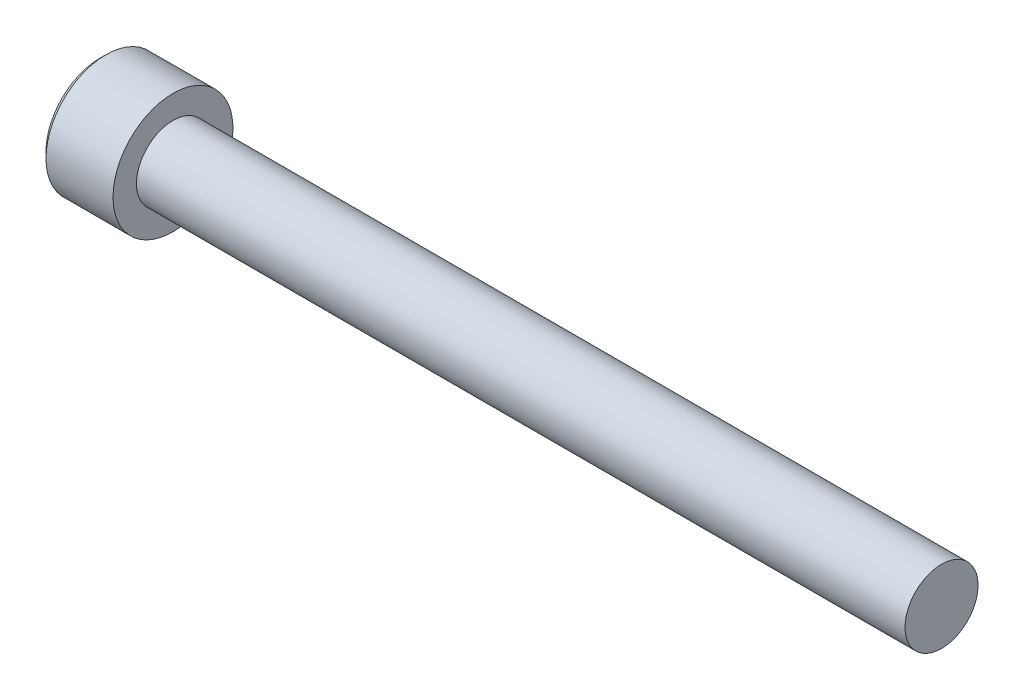
ISO-10303-21;
HEADER;
FILE_DESCRIPTION(('STEP AP214'),'2;1');
FILE_NAME('part.step','',(''),(''),'','','');
FILE_SCHEMA(('AUTOMOTIVE_DESIGN { 1 0 10303 214 1 1 1 1 }'));
ENDSEC;
DATA;
#1=APPLICATION_CONTEXT('core data for automotive mechanical design processes');
#2=APPLICATION_PROTOCOL_DEFINITION('international standard','automotive_design',2000,#1);
#3=PRODUCT_CONTEXT('',#1,'mechanical');
#4=PRODUCT('Part','Part','',(#3));
#5=PRODUCT_RELATED_PRODUCT_CATEGORY('part','',(#4));
#6=PRODUCT_DEFINITION_FORMATION('','',#4);
#7=PRODUCT_DEFINITION_CONTEXT('part definition',#1,'design');
#8=PRODUCT_DEFINITION('design','',#6,#7);
#9=PRODUCT_DEFINITION_SHAPE('','',#8);
#10=(LENGTH_UNIT() NAMED_UNIT(*) SI_UNIT(.MILLI.,.METRE.));
#11=(NAMED_UNIT(*) PLANE_ANGLE_UNIT() SI_UNIT($,.RADIAN.));
#12=(NAMED_UNIT(*) SI_UNIT($,.STERADIAN.) SOLID_ANGLE_UNIT());
#13=UNCERTAINTY_MEASURE_WITH_UNIT(LENGTH_MEASURE(1.E-05),#10,'distance_accuracy_value','');
#14=(GEOMETRIC_REPRESENTATION_CONTEXT(3) GLOBAL_UNCERTAINTY_ASSIGNED_CONTEXT((#13)) GLOBAL_UNIT_ASSIGNED_CONTEXT((#10,
#11,#12)) REPRESENTATION_CONTEXT('',''));
#15=CARTESIAN_POINT('',(0.,0.,0.));
#16=DIRECTION('',(0.,0.,1.));
#17=DIRECTION('',(1.,0.,0.));
#18=AXIS2_PLACEMENT_3D('',#15,#16,#17);
#19=CARTESIAN_POINT('',(-2.28600000000007,-1.14567944042317,1.984375));
#20=DIRECTION('',(0.,0.,1.));
#21=DIRECTION('',(1.,0.,0.));
#22=AXIS2_PLACEMENT_3D('',#19,#20,#21);
#23=PLANE('',#22);
#24=CARTESIAN_POINT('',(-4.82599999995852,1.14567944044653,1.98437499999554));
#25=CARTESIAN_POINT('',(-4.78691618362732,1.06743880343266,1.9843749999984));
#26=CARTESIAN_POINT('',(-4.75011447684892,0.987898318960917,1.98437499999957));
#27=CARTESIAN_POINT('',(-4.68265620500518,0.825677042028778,1.98437500000043));
#28=CARTESIAN_POINT('',(-4.65204056061138,0.742979382529199,1.98437500000012));
#29=CARTESIAN_POINT('',(-4.5991739228306,0.575193959555969,1.98437499999988));
#30=CARTESIAN_POINT('',(-4.57689462080725,0.490115359117279,1.98437499999997));
#31=CARTESIAN_POINT('',(-4.54259467221837,0.318093091130193,1.98437500000003));
#32=CARTESIAN_POINT('',(-4.5305423022885,0.231156054976726,1.984375));
#33=CARTESIAN_POINT('',(-4.52249110263747,0.119918521511051,1.984375));
#34=CARTESIAN_POINT('',(-4.52118947557477,0.0959468443046798,1.984375));
#35=CARTESIAN_POINT('',(-4.51945182629813,0.0479845644411998,1.984375));
#36=CARTESIAN_POINT('',(-4.51901533386223,0.0239939791589393,1.984375));
#37=CARTESIAN_POINT('',(-4.51901809008399,-0.0602201717457363,1.984375));
#38=CARTESIAN_POINT('',(-4.52177452299902,-0.120461721905447,1.984375));
#39=CARTESIAN_POINT('',(-4.5326365512493,-0.240474970989197,1.984375));
#40=CARTESIAN_POINT('',(-4.54074587749718,-0.300246312758427,1.984375));
#41=CARTESIAN_POINT('',(-4.57259622946939,-0.478763752804282,1.984375));
#42=CARTESIAN_POINT('',(-4.60385422611702,-0.596208828937734,1.984375));
#43=CARTESIAN_POINT('',(-4.66780003592237,-0.785921487441256,1.984375));
#44=CARTESIAN_POINT('',(-4.69623457768558,-0.859734609866899,1.984375));
#45=CARTESIAN_POINT('',(-4.75786140400812,-1.00456595519282,1.984375));
#46=CARTESIAN_POINT('',(-4.79100779300359,-1.07560356657101,1.984375));
#47=CARTESIAN_POINT('',(-4.82599999995643,-1.14567944044724,1.984375));
#48=B_SPLINE_CURVE_WITH_KNOTS('',3,(#24,#25,#26,#27,#28,#29,#30,#31,#32,#33,#34,#35,#36,#37,#38,
#39,#40,#41,#42,#43,#44,#45,#46,#47),.UNSPECIFIED.,.F.,.F.,(4,2,2,2,2,2,2,2,2,2,2,4),(0.,
0.262559005207405,0.526801735838036,0.790138824405318,1.05265603861765,1.12466619182083,
1.19663719499031,1.3772702672652,1.55802937209382,1.92104085090328,2.15819130092264,
2.39317265078575),.UNSPECIFIED.);
#49=CARTESIAN_POINT('',(-4.82599999996829,1.14567944041753,1.98437500003084));
#50=VERTEX_POINT('',#49);
#51=CARTESIAN_POINT('',(-4.8259999999622,-1.14567944043207,1.98437500001542));
#52=VERTEX_POINT('',#51);
#53=EDGE_CURVE('E21',#50,#52,#48,.T.);
#54=ORIENTED_EDGE('',*,*,#53,.F.);
#55=DIRECTION('',(1.,0.,0.));
#56=VECTOR('',#55,1.);
#57=CARTESIAN_POINT('',(-2.28600000000007,1.14567944042316,1.984375));
#58=LINE('',#57,#56);
#59=CARTESIAN_POINT('',(-2.28600000000007,1.14567944042316,1.984375));
#60=VERTEX_POINT('',#59);
#61=EDGE_CURVE('E69',#50,#60,#58,.T.);
#62=ORIENTED_EDGE('',*,*,#61,.T.);
#63=DIRECTION('',(0.,1.,0.));
#64=VECTOR('',#63,1.);
#65=CARTESIAN_POINT('',(-2.28600000000007,0.,1.984375));
#66=LINE('',#65,#64);
#67=CARTESIAN_POINT('',(-2.28600000000007,-1.14567944042317,1.984375));
#68=VERTEX_POINT('',#67);
#69=EDGE_CURVE('E75',#68,#60,#66,.T.);
#70=ORIENTED_EDGE('',*,*,#69,.F.);
#71=DIRECTION('',(1.,0.,0.));
#72=VECTOR('',#71,1.);
#73=CARTESIAN_POINT('',(-2.28600000000007,-1.14567944042317,1.984375));
#74=LINE('',#73,#72);
#75=EDGE_CURVE('E72',#68,#52,#74,.F.);
#76=ORIENTED_EDGE('',*,*,#75,.T.);
#77=EDGE_LOOP('',(#54,#62,#70,#76));
#78=FACE_BOUND('',#77,.T.);
#79=ADVANCED_FACE('F17',(#78),#23,.F.);
#80=CARTESIAN_POINT('',(-2.28600000000007,0.,0.));
#81=DIRECTION('',(-1.,0.,0.));
#82=DIRECTION('',(0.,0.,1.));
#83=AXIS2_PLACEMENT_3D('',#80,#81,#82);
#84=PLANE('',#83);
#85=DIRECTION('',(0.,0.5,0.866025403784439));
#86=VECTOR('',#85,1.);
#87=CARTESIAN_POINT('',(-2.28600000000007,2.29135888084633,0.));
#88=LINE('',#87,#86);
#89=CARTESIAN_POINT('',(-2.28600000000007,2.29135888084633,0.));
#90=VERTEX_POINT('',#89);
#91=CARTESIAN_POINT('',(-2.28600000000007,1.14567944042316,-1.984375));
#92=VERTEX_POINT('',#91);
#93=EDGE_CURVE('E83',#90,#92,#88,.F.);
#94=ORIENTED_EDGE('',*,*,#93,.T.);
#95=DIRECTION('',(0.,1.,0.));
#96=VECTOR('',#95,1.);
#97=CARTESIAN_POINT('',(-2.28600000000007,1.14567944042316,-1.984375));
#98=LINE('',#97,#96);
#99=CARTESIAN_POINT('',(-2.28600000000007,-1.14567944042316,-1.984375));
#100=VERTEX_POINT('',#99);
#101=EDGE_CURVE('E243',#92,#100,#98,.F.);
#102=ORIENTED_EDGE('',*,*,#101,.T.);
#103=DIRECTION('',(0.,0.5,-0.866025403784439));
#104=VECTOR('',#103,1.);
#105=CARTESIAN_POINT('',(-2.28600000000007,-1.14567944042316,-1.984375));
#106=LINE('',#105,#104);
#107=CARTESIAN_POINT('',(-2.28600000000007,-2.29135888084633,0.));
#108=VERTEX_POINT('',#107);
#109=EDGE_CURVE('E228',#100,#108,#106,.F.);
#110=ORIENTED_EDGE('',*,*,#109,.T.);
#111=DIRECTION('',(0.,-0.5,-0.866025403784439));
#112=VECTOR('',#111,1.);
#113=CARTESIAN_POINT('',(-2.28600000000007,-2.29135888084633,0.));
#114=LINE('',#113,#112);
#115=EDGE_CURVE('E225',#108,#68,#114,.F.);
#116=ORIENTED_EDGE('',*,*,#115,.T.);
#117=ORIENTED_EDGE('',*,*,#69,.T.);
#118=DIRECTION('',(0.,-0.5,0.866025403784439));
#119=VECTOR('',#118,1.);
#120=CARTESIAN_POINT('',(-2.28600000000007,1.14567944042316,1.984375));
#121=LINE('',#120,#119);
#122=EDGE_CURVE('E82',#60,#90,#121,.F.);
#123=ORIENTED_EDGE('',*,*,#122,.T.);
#124=EDGE_LOOP('',(#94,#102,#110,#116,#117,#123));
#125=FACE_BOUND('',#124,.T.);
#126=ADVANCED_FACE('F161',(#125),#84,.T.);
#127=CARTESIAN_POINT('',(-2.28600000000007,-1.14567944042316,-1.984375));
#128=DIRECTION('',(0.,-0.866025403784439,-0.5));
#129=DIRECTION('',(0.,0.5,-0.866025403784439));
#130=AXIS2_PLACEMENT_3D('',#127,#128,#129);
#131=PLANE('',#130);
#132=CARTESIAN_POINT('',(-4.82599999995871,-1.14567944040756,-1.98437500001887));
#133=CARTESIAN_POINT('',(-4.78666022792997,-1.18505700230148,-1.91617106214563));
#134=CARTESIAN_POINT('',(-4.74963132844072,-1.22509295783734,-1.8468267530301));
#135=CARTESIAN_POINT('',(-4.68183299424977,-1.30673037975396,-1.70542659047317));
#136=CARTESIAN_POINT('',(-4.65110127019237,-1.34833960561553,-1.63335729721673));
#137=CARTESIAN_POINT('',(-4.59845762010516,-1.432242568594,-1.48803310243203));
#138=CARTESIAN_POINT('',(-4.57641341195893,-1.47451494967301,-1.41481519064643));
#139=CARTESIAN_POINT('',(-4.54245011067441,-1.55999007976842,-1.26676792253773));
#140=CARTESIAN_POINT('',(-4.53050567471972,-1.6031902195197,-1.19194308559438));
#141=CARTESIAN_POINT('',(-4.51972842752365,-1.67764765054852,-1.06297903205139));
#142=CARTESIAN_POINT('',(-4.51813352794834,-1.70880881707173,-1.00900630841009));
#143=CARTESIAN_POINT('',(-4.52082392138599,-1.77108016542046,-0.901149169214274));
#144=CARTESIAN_POINT('',(-4.52511127545884,-1.80219032554946,-0.847264791239237));
#145=CARTESIAN_POINT('',(-4.53932219421538,-1.86411684097343,-0.740004920189235));
#146=CARTESIAN_POINT('',(-4.54925206045723,-1.8949328285454,-0.686630064029166));
#147=CARTESIAN_POINT('',(-4.5742029484467,-1.95603190279815,-0.580803363127978));
#148=CARTESIAN_POINT('',(-4.58922357974385,-1.98631503016081,-0.528351447923769));
#149=CARTESIAN_POINT('',(-4.63380478900425,-2.06386502548479,-0.394030915895904));
#150=CARTESIAN_POINT('',(-4.66672213384104,-2.11065153226583,-0.312994309042484));
#151=CARTESIAN_POINT('',(-4.72228952038986,-2.17944749410732,-0.193836207777459));
#152=CARTESIAN_POINT('',(-4.74181309375939,-2.20211890802843,-0.154568166986659));
#153=CARTESIAN_POINT('',(-4.78263970065987,-2.24704195201531,-0.0767591723707469));
#154=CARTESIAN_POINT('',(-4.80394164363173,-2.2692938292399,-0.0382177904539708));
#155=CARTESIAN_POINT('',(-4.82599999995675,-2.29135888085868,2.13931096265935E-11));
#156=B_SPLINE_CURVE_WITH_KNOTS('',3,(#132,#133,#134,#135,#136,#137,#138,#139,#140,#141,#142,
#143,#144,#145,#146,#147,#148,#149,#150,#151,#152,#153,#154,#155),.UNSPECIFIED.,.F.,.F.,(4,2,2,
2,2,2,2,2,2,2,2,4),(0.,0.264284909626495,0.530108996358094,0.791712695414128,1.05265800174404,
1.23942150116703,1.42625045663858,1.61328847394198,1.80031214908683,2.09727151182814,
2.24534838946042,2.39333511890876),.UNSPECIFIED.);
#157=CARTESIAN_POINT('',(-4.8259999999622,-1.14567944043207,-1.98437500001542));
#158=VERTEX_POINT('',#157);
#159=CARTESIAN_POINT('',(-4.82599999996846,-2.2913588808704,-2.00043543490866E-11));
#160=VERTEX_POINT('',#159);
#161=EDGE_CURVE('E163',#158,#160,#156,.T.);
#162=ORIENTED_EDGE('',*,*,#161,.T.);
#163=DIRECTION('',(1.,0.,0.));
#164=VECTOR('',#163,1.);
#165=CARTESIAN_POINT('',(-2.28600000000007,-2.29135888084633,0.));
#166=LINE('',#165,#164);
#167=EDGE_CURVE('E236',#160,#108,#166,.T.);
#168=ORIENTED_EDGE('',*,*,#167,.T.);
#169=ORIENTED_EDGE('',*,*,#109,.F.);
#170=DIRECTION('',(-1.,0.,0.));
#171=VECTOR('',#170,1.);
#172=CARTESIAN_POINT('',(-2.28600000000007,-1.14567944042316,-1.984375));
#173=LINE('',#172,#171);
#174=EDGE_CURVE('E246',#100,#158,#173,.T.);
#175=ORIENTED_EDGE('',*,*,#174,.T.);
#176=EDGE_LOOP('',(#162,#168,#169,#175));
#177=FACE_BOUND('',#176,.T.);
#178=ADVANCED_FACE('F157',(#177),#131,.F.);
#179=CARTESIAN_POINT('',(-2.28600000000007,-2.29135888084633,0.));
#180=DIRECTION('',(0.,-0.866025403784439,0.5));
#181=DIRECTION('',(0.,-0.5,-0.866025403784439));
#182=AXIS2_PLACEMENT_3D('',#179,#180,#181);
#183=PLANE('',#182);
#184=CARTESIAN_POINT('',(-4.8259999999587,-2.29135888085486,-2.29477011545215E-11));
#185=CARTESIAN_POINT('',(-4.78666022792997,-2.25198131896546,0.0682039378529047));
#186=CARTESIAN_POINT('',(-4.74963132844072,-2.21194536343147,0.137548246969502));
#187=CARTESIAN_POINT('',(-4.68183299424977,-2.13030794151622,0.278948409527228));
#188=CARTESIAN_POINT('',(-4.65110127019237,-2.08869871565414,0.351017702783377));
#189=CARTESIAN_POINT('',(-4.59845762010516,-2.00479575267531,0.496341897567867));
#190=CARTESIAN_POINT('',(-4.57641341195893,-1.96252337159644,0.569559809353539));
#191=CARTESIAN_POINT('',(-4.5424501106744,-1.87704824150112,0.717607077462299));
#192=CARTESIAN_POINT('',(-4.53050567471972,-1.8338481017498,0.792431914405622));
#193=CARTESIAN_POINT('',(-4.51972842752365,-1.75939067072096,0.921395967948603));
#194=CARTESIAN_POINT('',(-4.51813352794834,-1.72822950419776,0.975368691589913));
#195=CARTESIAN_POINT('',(-4.52082392138599,-1.66595815584903,1.08322583078573));
#196=CARTESIAN_POINT('',(-4.52511127545884,-1.63484799572003,1.13711020876076));
#197=CARTESIAN_POINT('',(-4.53932219421538,-1.57292148029607,1.24437007981077));
#198=CARTESIAN_POINT('',(-4.54925206045723,-1.54210549272409,1.29774493597084));
#199=CARTESIAN_POINT('',(-4.5742029484467,-1.48100641847134,1.40357163687202));
#200=CARTESIAN_POINT('',(-4.58922357974385,-1.45072329110868,1.45602355207623));
#201=CARTESIAN_POINT('',(-4.63380478900421,-1.37317329578476,1.59034408410398));
#202=CARTESIAN_POINT('',(-4.66672213384095,-1.32638678900379,1.6713806909573));
#203=CARTESIAN_POINT('',(-4.72228952038968,-1.25759082716239,1.79053879222216));
#204=CARTESIAN_POINT('',(-4.74181309375917,-1.23491941324131,1.82980683301291));
#205=CARTESIAN_POINT('',(-4.78263970065959,-1.18999636925449,1.90761582762873));
#206=CARTESIAN_POINT('',(-4.8039416436314,-1.16774449202993,1.94615720954545));
#207=CARTESIAN_POINT('',(-4.82599999995639,-1.14567944041117,1.98437500002077));
#208=B_SPLINE_CURVE_WITH_KNOTS('',3,(#184,#185,#186,#187,#188,#189,#190,#191,#192,#193,#194,
#195,#196,#197,#198,#199,#200,#201,#202,#203,#204,#205,#206,#207),.UNSPECIFIED.,.F.,.F.,(4,2,2,
2,2,2,2,2,2,2,2,4),(0.,0.264284909626493,0.530108996358089,0.791712695414125,1.05265800174404,
1.23942150116703,1.42625045663858,1.61328847394198,1.80031214908683,2.09727151182773,
2.24534838945981,2.39333511890795),.UNSPECIFIED.);
#209=EDGE_CURVE('E92',#160,#52,#208,.T.);
#210=ORIENTED_EDGE('',*,*,#209,.T.);
#211=ORIENTED_EDGE('',*,*,#75,.F.);
#212=ORIENTED_EDGE('',*,*,#115,.F.);
#213=ORIENTED_EDGE('',*,*,#167,.F.);
#214=EDGE_LOOP('',(#210,#211,#212,#213));
#215=FACE_BOUND('',#214,.T.);
#216=ADVANCED_FACE('F152',(#215),#183,.F.);
#217=CARTESIAN_POINT('',(-2.28600000000007,1.14567944042316,1.984375));
#218=DIRECTION('',(0.,0.866025403784439,0.5));
#219=DIRECTION('',(0.,-0.5,0.866025403784439));
#220=AXIS2_PLACEMENT_3D('',#217,#218,#219);
#221=PLANE('',#220);
#222=CARTESIAN_POINT('',(-4.82599999995852,1.14567944040762,1.98437500001801));
#223=CARTESIAN_POINT('',(-4.78666022792973,1.1850570023017,1.91617106214498));
#224=CARTESIAN_POINT('',(-4.74963132844047,1.22509295783761,1.84682675302957));
#225=CARTESIAN_POINT('',(-4.68183299424957,1.30673037975422,1.70542659047278));
#226=CARTESIAN_POINT('',(-4.65110127019222,1.34833960561574,1.63335729721638));
#227=CARTESIAN_POINT('',(-4.59845762010509,1.43224256859413,1.48803310243178));
#228=CARTESIAN_POINT('',(-4.57641341195888,1.47451494967311,1.41481519064625));
#229=CARTESIAN_POINT('',(-4.54245011067439,1.55999007976846,1.26676792253767));
#230=CARTESIAN_POINT('',(-4.53050567471972,1.6031902195197,1.19194308559439));
#231=CARTESIAN_POINT('',(-4.51972842752365,1.67764765054848,1.06297903205146));
#232=CARTESIAN_POINT('',(-4.51813352794835,1.70880881707169,1.00900630841016));
#233=CARTESIAN_POINT('',(-4.52082392138598,1.77108016542041,0.901149169214364));
#234=CARTESIAN_POINT('',(-4.52511127545883,1.80219032554941,0.847264791239333));
#235=CARTESIAN_POINT('',(-4.53932219421536,1.86411684097336,0.740004920189342));
#236=CARTESIAN_POINT('',(-4.54925206045721,1.89493282854533,0.686630064029278));
#237=CARTESIAN_POINT('',(-4.57420294844667,1.95603190279808,0.5808033631281));
#238=CARTESIAN_POINT('',(-4.58922357974382,1.98631503016074,0.528351447923897));
#239=CARTESIAN_POINT('',(-4.6338047890042,2.06386502548473,0.394030915896012));
#240=CARTESIAN_POINT('',(-4.666722133841,2.11065153226578,0.312994309042568));
#241=CARTESIAN_POINT('',(-4.72228952038984,2.17944749410729,0.19383620777751));
#242=CARTESIAN_POINT('',(-4.74181309375937,2.20211890802841,0.1545681669867));
#243=CARTESIAN_POINT('',(-4.78263970065986,2.24704195201529,0.0767591723707674));
#244=CARTESIAN_POINT('',(-4.80394164363172,2.26929382923989,0.0382177904539813));
#245=CARTESIAN_POINT('',(-4.82599999995675,2.29135888085868,-2.1392886942985E-11));
#246=B_SPLINE_CURVE_WITH_KNOTS('',3,(#222,#223,#224,#225,#226,#227,#228,#229,#230,#231,#232,
#233,#234,#235,#236,#237,#238,#239,#240,#241,#242,#243,#244,#245),.UNSPECIFIED.,.F.,.F.,(4,2,2,
2,2,2,2,2,2,2,2,4),(0.,0.26428490962629,0.530108996357672,0.791712695413487,1.05265800174319,
1.23942150116616,1.42625045663768,1.61328847394106,1.80031214908589,2.09727151182728,
2.2453483894596,2.39333511890798),.UNSPECIFIED.);
#247=CARTESIAN_POINT('',(-4.82599999996846,2.29135888087039,2.00042061038936E-11));
#248=VERTEX_POINT('',#247);
#249=EDGE_CURVE('E80',#50,#248,#246,.T.);
#250=ORIENTED_EDGE('',*,*,#249,.T.);
#251=DIRECTION('',(1.,0.,0.));
#252=VECTOR('',#251,1.);
#253=CARTESIAN_POINT('',(-2.28600000000007,2.29135888084633,0.));
#254=LINE('',#253,#252);
#255=EDGE_CURVE('E247',#248,#90,#254,.T.);
#256=ORIENTED_EDGE('',*,*,#255,.T.);
#257=ORIENTED_EDGE('',*,*,#122,.F.);
#258=ORIENTED_EDGE('',*,*,#61,.F.);
#259=EDGE_LOOP('',(#250,#256,#257,#258));
#260=FACE_BOUND('',#259,.T.);
#261=ADVANCED_FACE('F77',(#260),#221,.F.);
#262=CARTESIAN_POINT('',(-2.28600000000007,2.29135888084633,0.));
#263=DIRECTION('',(0.,0.866025403784439,-0.5));
#264=DIRECTION('',(0.,0.5,0.866025403784439));
#265=AXIS2_PLACEMENT_3D('',#262,#263,#264);
#266=PLANE('',#265);
#267=CARTESIAN_POINT('',(-4.82599999995871,2.29135888085486,2.29489280696874E-11));
#268=CARTESIAN_POINT('',(-4.78666022792997,2.25198131896547,-0.0682039378529039));
#269=CARTESIAN_POINT('',(-4.74963132844072,2.21194536343147,-0.137548246969502));
#270=CARTESIAN_POINT('',(-4.68183299424977,2.13030794151622,-0.278948409527229));
#271=CARTESIAN_POINT('',(-4.65110127019237,2.08869871565414,-0.351017702783379));
#272=CARTESIAN_POINT('',(-4.59845762010516,2.00479575267531,-0.496341897567869));
#273=CARTESIAN_POINT('',(-4.57641341195893,1.96252337159644,-0.569559809353541));
#274=CARTESIAN_POINT('',(-4.5424501106744,1.87704824150112,-0.7176070774623));
#275=CARTESIAN_POINT('',(-4.53050567471972,1.8338481017498,-0.792431914405622));
#276=CARTESIAN_POINT('',(-4.51972842752365,1.75939067072096,-0.921395967948603));
#277=CARTESIAN_POINT('',(-4.51813352794834,1.72822950419776,-0.975368691589912));
#278=CARTESIAN_POINT('',(-4.52082392138599,1.66595815584903,-1.08322583078573));
#279=CARTESIAN_POINT('',(-4.52511127545884,1.63484799572003,-1.13711020876076));
#280=CARTESIAN_POINT('',(-4.53932219421538,1.57292148029607,-1.24437007981077));
#281=CARTESIAN_POINT('',(-4.54925206045723,1.54210549272409,-1.29774493597083));
#282=CARTESIAN_POINT('',(-4.5742029484467,1.48100641847134,-1.40357163687202));
#283=CARTESIAN_POINT('',(-4.58922357974385,1.45072329110868,-1.45602355207623));
#284=CARTESIAN_POINT('',(-4.63380478900425,1.3731732957847,-1.5903440841041));
#285=CARTESIAN_POINT('',(-4.66672213384104,1.32638678900366,-1.67138069095752));
#286=CARTESIAN_POINT('',(-4.72228952038986,1.25759082716218,-1.79053879222254));
#287=CARTESIAN_POINT('',(-4.74181309375939,1.23491941324106,-1.82980683301334));
#288=CARTESIAN_POINT('',(-4.78263970065987,1.18999636925419,-1.90761582762925));
#289=CARTESIAN_POINT('',(-4.80394164363173,1.1677444920296,-1.94615720954603));
#290=CARTESIAN_POINT('',(-4.82599999995675,1.14567944041081,-1.98437500002139));
#291=B_SPLINE_CURVE_WITH_KNOTS('',3,(#267,#268,#269,#270,#271,#272,#273,#274,#275,#276,#277,
#278,#279,#280,#281,#282,#283,#284,#285,#286,#287,#288,#289,#290),.UNSPECIFIED.,.F.,.F.,(4,2,2,
2,2,2,2,2,2,2,2,4),(0.,0.264284909626495,0.530108996358093,0.791712695414127,1.05265800174404,
1.23942150116703,1.42625045663858,1.61328847394198,1.80031214908683,2.09727151182814,
2.24534838946042,2.39333511890876),.UNSPECIFIED.);
#292=CARTESIAN_POINT('',(-4.82599999996846,1.14567944045252,-1.98437500001084));
#293=VERTEX_POINT('',#292);
#294=EDGE_CURVE('E40',#248,#293,#291,.T.);
#295=ORIENTED_EDGE('',*,*,#294,.T.);
#296=DIRECTION('',(-1.,0.,0.));
#297=VECTOR('',#296,1.);
#298=CARTESIAN_POINT('',(-2.28600000000007,1.14567944042316,-1.984375));
#299=LINE('',#298,#297);
#300=EDGE_CURVE('E167',#293,#92,#299,.F.);
#301=ORIENTED_EDGE('',*,*,#300,.T.);
#302=ORIENTED_EDGE('',*,*,#93,.F.);
#303=ORIENTED_EDGE('',*,*,#255,.F.);
#304=EDGE_LOOP('',(#295,#301,#302,#303));
#305=FACE_BOUND('',#304,.T.);
#306=ADVANCED_FACE('F151',(#305),#266,.F.);
#307=CARTESIAN_POINT('',(-2.28600000000007,1.14567944042316,-1.984375));
#308=DIRECTION('',(0.,0.,-1.));
#309=DIRECTION('',(-1.,0.,0.));
#310=AXIS2_PLACEMENT_3D('',#307,#308,#309);
#311=PLANE('',#310);
#312=CARTESIAN_POINT('',(-4.8259999999587,1.14567944044731,-1.98437499999592));
#313=CARTESIAN_POINT('',(-4.78666022793094,1.06692431665146,-1.98437499999853));
#314=CARTESIAN_POINT('',(-4.74963132844318,0.986852405569011,-1.98437499999961));
#315=CARTESIAN_POINT('',(-4.6818329942566,0.823577561711963,-1.9843750000004));
#316=CARTESIAN_POINT('',(-4.65110127020207,0.740359109975722,-1.98437500000011));
#317=CARTESIAN_POINT('',(-4.59845762012233,0.572553183993917,-1.9843749999999));
#318=CARTESIAN_POINT('',(-4.57641341198063,0.488008421824127,-1.98437499999997));
#319=CARTESIAN_POINT('',(-4.54245011070673,0.317058161610178,-1.98437500000003));
#320=CARTESIAN_POINT('',(-4.53050567475816,0.230657882096267,-1.98437500000001));
#321=CARTESIAN_POINT('',(-4.51972842757294,0.0817430200124032,-1.984375));
#322=CARTESIAN_POINT('',(-4.51813352800283,0.0194206869508218,-1.984375));
#323=CARTESIAN_POINT('',(-4.52082392145254,-0.1051220097764,-1.984375));
#324=CARTESIAN_POINT('',(-4.52511127553227,-0.167342330049008,-1.984375));
#325=CARTESIAN_POINT('',(-4.53932219430377,-0.291195360925477,-1.984375));
#326=CARTESIAN_POINT('',(-4.54925206055372,-0.352827336083362,-1.984375));
#327=CARTESIAN_POINT('',(-4.57420294856008,-0.475025484616114,-1.984375));
#328=CARTESIAN_POINT('',(-4.58922357986604,-0.535591739354747,-1.984375));
#329=CARTESIAN_POINT('',(-4.63380478912724,-0.690691729958653,-1.984375));
#330=CARTESIAN_POINT('',(-4.66672213394715,-0.784264743465576,-1.984375));
#331=CARTESIAN_POINT('',(-4.7222895204619,-0.921856667069616,-1.984375));
#332=CARTESIAN_POINT('',(-4.74181309381856,-0.967199494886089,-1.984375));
#333=CARTESIAN_POINT('',(-4.78263970069104,-1.05704558280959,-1.984375));
#334=CARTESIAN_POINT('',(-4.80394164364776,-1.10154933723428,-1.984375));
#335=CARTESIAN_POINT('',(-4.82599999995675,-1.14567944044787,-1.984375));
#336=B_SPLINE_CURVE_WITH_KNOTS('',3,(#312,#313,#314,#315,#316,#317,#318,#319,#320,#321,#322,
#323,#324,#325,#326,#327,#328,#329,#330,#331,#332,#333,#334,#335),.UNSPECIFIED.,.F.,.F.,(4,2,2,
2,2,2,2,2,2,2,2,4),(0.,0.264284909658836,0.530108996422784,0.791712695509868,1.0526580018708,
1.23942150133878,1.42625045685537,1.61328847420389,1.80031214939384,2.09727151196384,
2.24534838950992,2.39333511887245),.UNSPECIFIED.);
#337=EDGE_CURVE('E109',#293,#158,#336,.T.);
#338=ORIENTED_EDGE('',*,*,#337,.T.);
#339=ORIENTED_EDGE('',*,*,#174,.F.);
#340=ORIENTED_EDGE('',*,*,#101,.F.);
#341=ORIENTED_EDGE('',*,*,#300,.F.);
#342=EDGE_LOOP('',(#338,#339,#340,#341));
#343=FACE_BOUND('',#342,.T.);
#344=ADVANCED_FACE('F122',(#343),#311,.F.);
#345=CARTESIAN_POINT('',(-4.82599999998001,0.,0.));
#346=DIRECTION('',(-1.,0.,0.));
#347=DIRECTION('',(0.,0.,1.));
#348=AXIS2_PLACEMENT_3D('',#345,#346,#347);
#349=CONICAL_SURFACE('',#348,2.29135888088194,0.785398163397448);
#350=ORIENTED_EDGE('',*,*,#161,.F.);
#351=CARTESIAN_POINT('',(-4.82599999998001,0.,0.));
#352=DIRECTION('',(-1.,0.,0.));
#353=DIRECTION('',(0.,0.,1.));
#354=AXIS2_PLACEMENT_3D('',#351,#352,#353);
#355=CIRCLE('',#354,2.29135888088194);
#356=EDGE_CURVE('E106',#158,#160,#355,.T.);
#357=ORIENTED_EDGE('',*,*,#356,.T.);
#358=EDGE_LOOP('',(#350,#357));
#359=FACE_BOUND('',#358,.T.);
#360=ADVANCED_FACE('F168',(#359),#349,.F.);
#361=CARTESIAN_POINT('',(-4.82599999998001,0.,0.));
#362=DIRECTION('',(-1.,0.,0.));
#363=DIRECTION('',(0.,0.,1.));
#364=AXIS2_PLACEMENT_3D('',#361,#362,#363);
#365=CONICAL_SURFACE('',#364,2.29135888088194,0.785398163397448);
#366=ORIENTED_EDGE('',*,*,#209,.F.);
#367=CARTESIAN_POINT('',(-4.82599999998001,0.,0.));
#368=DIRECTION('',(-1.,0.,0.));
#369=DIRECTION('',(0.,0.,1.));
#370=AXIS2_PLACEMENT_3D('',#367,#368,#369);
#371=CIRCLE('',#370,2.29135888088194);
#372=EDGE_CURVE('E87',#160,#52,#371,.T.);
#373=ORIENTED_EDGE('',*,*,#372,.T.);
#374=EDGE_LOOP('',(#366,#373));
#375=FACE_BOUND('',#374,.T.);
#376=ADVANCED_FACE('F171',(#375),#365,.F.);
#377=CARTESIAN_POINT('',(-4.82599999998001,0.,0.));
#378=DIRECTION('',(-1.,0.,0.));
#379=DIRECTION('',(0.,0.,1.));
#380=AXIS2_PLACEMENT_3D('',#377,#378,#379);
#381=CONICAL_SURFACE('',#380,2.29135888088194,0.78539816348948);
#382=CARTESIAN_POINT('',(-4.82599999998001,0.,0.));
#383=DIRECTION('',(-1.,0.,0.));
#384=DIRECTION('',(0.,0.,1.));
#385=AXIS2_PLACEMENT_3D('',#382,#383,#384);
#386=CIRCLE('',#385,2.29135888088194);
#387=EDGE_CURVE('E60',#52,#50,#386,.T.);
#388=ORIENTED_EDGE('',*,*,#387,.T.);
#389=ORIENTED_EDGE('',*,*,#53,.T.);
#390=EDGE_LOOP('',(#388,#389));
#391=FACE_BOUND('',#390,.T.);
#392=ADVANCED_FACE('F85',(#391),#381,.F.);
#393=CARTESIAN_POINT('',(-4.82599999998001,0.,0.));
#394=DIRECTION('',(-1.,0.,0.));
#395=DIRECTION('',(0.,0.,1.));
#396=AXIS2_PLACEMENT_3D('',#393,#394,#395);
#397=CONICAL_SURFACE('',#396,2.29135888088194,0.785398163397448);
#398=ORIENTED_EDGE('',*,*,#249,.F.);
#399=CARTESIAN_POINT('',(-4.82599999998001,0.,0.));
#400=DIRECTION('',(-1.,0.,0.));
#401=DIRECTION('',(0.,0.,1.));
#402=AXIS2_PLACEMENT_3D('',#399,#400,#401);
#403=CIRCLE('',#402,2.29135888088194);
#404=EDGE_CURVE('E86',#50,#248,#403,.T.);
#405=ORIENTED_EDGE('',*,*,#404,.T.);
#406=EDGE_LOOP('',(#398,#405));
#407=FACE_BOUND('',#406,.T.);
#408=ADVANCED_FACE('F91',(#407),#397,.F.);
#409=CARTESIAN_POINT('',(-4.82599999998001,0.,0.));
#410=DIRECTION('',(-1.,0.,0.));
#411=DIRECTION('',(0.,0.,1.));
#412=AXIS2_PLACEMENT_3D('',#409,#410,#411);
#413=CONICAL_SURFACE('',#412,2.29135888088194,0.785398163397448);
#414=ORIENTED_EDGE('',*,*,#294,.F.);
#415=CARTESIAN_POINT('',(-4.82599999998001,0.,0.));
#416=DIRECTION('',(-1.,0.,0.));
#417=DIRECTION('',(0.,0.,1.));
#418=AXIS2_PLACEMENT_3D('',#415,#416,#417);
#419=CIRCLE('',#418,2.29135888088194);
#420=EDGE_CURVE('E98',#248,#293,#419,.T.);
#421=ORIENTED_EDGE('',*,*,#420,.T.);
#422=EDGE_LOOP('',(#414,#421));
#423=FACE_BOUND('',#422,.T.);
#424=ADVANCED_FACE('F129',(#423),#413,.F.);
#425=CARTESIAN_POINT('',(-4.82599999998001,0.,0.));
#426=DIRECTION('',(-1.,0.,0.));
#427=DIRECTION('',(0.,0.,1.));
#428=AXIS2_PLACEMENT_3D('',#425,#426,#427);
#429=CONICAL_SURFACE('',#428,2.29135888088194,0.785398163489476);
#430=ORIENTED_EDGE('',*,*,#337,.F.);
#431=CARTESIAN_POINT('',(-4.82599999998001,0.,0.));
#432=DIRECTION('',(-1.,0.,0.));
#433=DIRECTION('',(0.,0.,1.));
#434=AXIS2_PLACEMENT_3D('',#431,#432,#433);
#435=CIRCLE('',#434,2.29135888088194);
#436=EDGE_CURVE('E100',#293,#158,#435,.T.);
#437=ORIENTED_EDGE('',*,*,#436,.T.);
#438=EDGE_LOOP('',(#430,#437));
#439=FACE_BOUND('',#438,.T.);
#440=ADVANCED_FACE('F125',(#439),#429,.F.);
#441=CARTESIAN_POINT('',(-4.82600000000007,0.,0.));
#442=DIRECTION('',(1.,0.,0.));
#443=DIRECTION('',(0.,0.,-1.));
#444=AXIS2_PLACEMENT_3D('',#441,#442,#443);
#445=PLANE('',#444);
#446=CARTESIAN_POINT('',(-4.82599999998001,0.,0.));
#447=DIRECTION('',(1.,0.,0.));
#448=DIRECTION('',(0.,0.,-1.));
#449=AXIS2_PLACEMENT_3D('',#446,#447,#448);
#450=CIRCLE('',#449,3.56615999999121);
#451=CARTESIAN_POINT('',(-4.82599999998001,0.,-3.56615999999121));
#452=VERTEX_POINT('',#451);
#453=EDGE_CURVE('E213',#452,#452,#450,.T.);
#454=ORIENTED_EDGE('',*,*,#453,.F.);
#455=EDGE_LOOP('',(#454));
#456=FACE_BOUND('',#455,.T.);
#457=ORIENTED_EDGE('',*,*,#420,.F.);
#458=ORIENTED_EDGE('',*,*,#404,.F.);
#459=ORIENTED_EDGE('',*,*,#387,.F.);
#460=ORIENTED_EDGE('',*,*,#372,.F.);
#461=ORIENTED_EDGE('',*,*,#356,.F.);
#462=ORIENTED_EDGE('',*,*,#436,.F.);
#463=EDGE_LOOP('',(#457,#458,#459,#460,#461,#462));
#464=FACE_BOUND('',#463,.T.);
#465=ADVANCED_FACE('F95',(#456,#464),#445,.F.);
#466=CARTESIAN_POINT('',(-4.42976000010731,0.,0.));
#467=DIRECTION('',(1.,0.,0.));
#468=DIRECTION('',(0.,0.,-1.));
#469=AXIS2_PLACEMENT_3D('',#466,#467,#468);
#470=CONICAL_SURFACE('',#469,3.96239999986392,0.785398163397448);
#471=CARTESIAN_POINT('',(-4.42976000000007,0.,0.));
#472=DIRECTION('',(-1.,0.,0.));
#473=DIRECTION('',(0.,0.,1.));
#474=AXIS2_PLACEMENT_3D('',#471,#472,#473);
#475=CIRCLE('',#474,3.9624);
#476=CARTESIAN_POINT('',(-4.42976000000007,0.,3.9624));
#477=VERTEX_POINT('',#476);
#478=EDGE_CURVE('E210',#477,#477,#475,.F.);
#479=ORIENTED_EDGE('',*,*,#478,.F.);
#480=EDGE_LOOP('',(#479));
#481=FACE_BOUND('',#480,.T.);
#482=ORIENTED_EDGE('',*,*,#453,.T.);
#483=EDGE_LOOP('',(#482));
#484=FACE_BOUND('',#483,.T.);
#485=ADVANCED_FACE('F199',(#481,#484),#470,.T.);
#486=CARTESIAN_POINT('',(-4.82600000000008,0.,0.));
#487=DIRECTION('',(-1.,0.,0.));
#488=DIRECTION('',(0.,0.,1.));
#489=AXIS2_PLACEMENT_3D('',#486,#487,#488);
#490=CYLINDRICAL_SURFACE('',#489,3.9624);
#491=ORIENTED_EDGE('',*,*,#478,.T.);
#492=EDGE_LOOP('',(#491));
#493=FACE_BOUND('',#492,.T.);
#494=CARTESIAN_POINT('',(0.,0.,0.));
#495=DIRECTION('',(-1.,0.,0.));
#496=DIRECTION('',(0.,0.,1.));
#497=AXIS2_PLACEMENT_3D('',#494,#495,#496);
#498=CIRCLE('',#497,3.9624);
#499=CARTESIAN_POINT('',(0.,0.,3.9624));
#500=VERTEX_POINT('',#499);
#501=EDGE_CURVE('E215',#500,#500,#498,.T.);
#502=ORIENTED_EDGE('',*,*,#501,.T.);
#503=EDGE_LOOP('',(#502));
#504=FACE_BOUND('',#503,.T.);
#505=ADVANCED_FACE('F196',(#493,#504),#490,.T.);
#506=CARTESIAN_POINT('',(50.8,0.,0.));
#507=DIRECTION('',(1.,0.,0.));
#508=DIRECTION('',(0.,0.,-1.));
#509=AXIS2_PLACEMENT_3D('',#506,#507,#508);
#510=PLANE('',#509);
#511=CARTESIAN_POINT('',(50.8,0.,0.));
#512=DIRECTION('',(-1.,0.,0.));
#513=DIRECTION('',(0.,0.,1.));
#514=AXIS2_PLACEMENT_3D('',#511,#512,#513);
#515=CIRCLE('',#514,2.413);
#516=CARTESIAN_POINT('',(50.8,0.,2.413));
#517=VERTEX_POINT('',#516);
#518=EDGE_CURVE('E31',#517,#517,#515,.T.);
#519=ORIENTED_EDGE('',*,*,#518,.F.);
#520=EDGE_LOOP('',(#519));
#521=FACE_BOUND('',#520,.T.);
#522=ADVANCED_FACE('F189',(#521),#510,.T.);
#523=CARTESIAN_POINT('',(0.,3.9624,0.));
#524=DIRECTION('',(-1.,0.,0.));
#525=DIRECTION('',(0.,0.,1.));
#526=AXIS2_PLACEMENT_3D('',#523,#524,#525);
#527=PLANE('',#526);
#528=CARTESIAN_POINT('',(0.,0.,0.));
#529=DIRECTION('',(-1.,0.,0.));
#530=DIRECTION('',(0.,0.,1.));
#531=AXIS2_PLACEMENT_3D('',#528,#529,#530);
#532=CIRCLE('',#531,2.413);
#533=CARTESIAN_POINT('',(0.,0.,2.413));
#534=VERTEX_POINT('',#533);
#535=EDGE_CURVE('E11',#534,#534,#532,.F.);
#536=ORIENTED_EDGE('',*,*,#535,.F.);
#537=EDGE_LOOP('',(#536));
#538=FACE_BOUND('',#537,.T.);
#539=ORIENTED_EDGE('',*,*,#501,.F.);
#540=EDGE_LOOP('',(#539));
#541=FACE_BOUND('',#540,.T.);
#542=ADVANCED_FACE('F183',(#538,#541),#527,.F.);
#543=CARTESIAN_POINT('',(50.8,0.,0.));
#544=DIRECTION('',(-1.,0.,0.));
#545=DIRECTION('',(0.,0.,1.));
#546=AXIS2_PLACEMENT_3D('',#543,#544,#545);
#547=CYLINDRICAL_SURFACE('',#546,2.413);
#548=ORIENTED_EDGE('',*,*,#535,.T.);
#549=EDGE_LOOP('',(#548));
#550=FACE_BOUND('',#549,.T.);
#551=ORIENTED_EDGE('',*,*,#518,.T.);
#552=EDGE_LOOP('',(#551));
#553=FACE_BOUND('',#552,.T.);
#554=ADVANCED_FACE('F181',(#550,#553),#547,.T.);
#555=CLOSED_SHELL('',(#79,#126,#178,#216,#261,#306,#344,#360,#376,#392,#408,#424,#440,#465,#485,
#505,#522,#542,#554));
#556=MANIFOLD_SOLID_BREP('B1',#555);
#557=ADVANCED_BREP_SHAPE_REPRESENTATION('',(#18,#556),#14);
#558=SHAPE_DEFINITION_REPRESENTATION(#9,#557);
ENDSEC;
END-ISO-10303-21;
